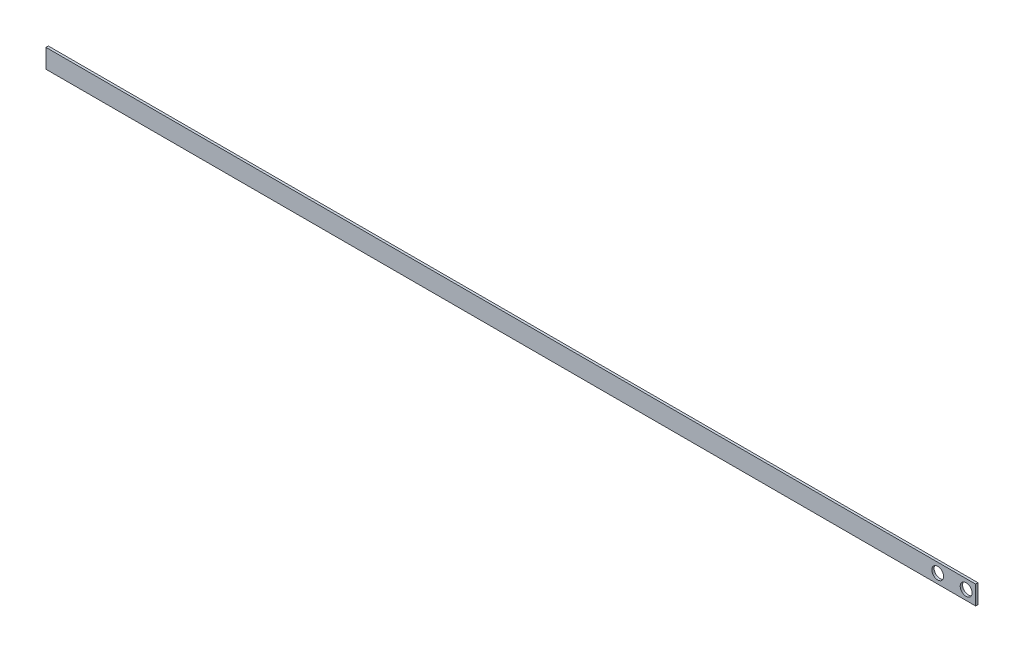
ISO-10303-21;
HEADER;
FILE_DESCRIPTION(('STEP AP214'),'2;1');
FILE_NAME('part.step','',(''),(''),'','','');
FILE_SCHEMA(('AUTOMOTIVE_DESIGN { 1 0 10303 214 1 1 1 1 }'));
ENDSEC;
DATA;
#1=APPLICATION_CONTEXT('core data for automotive mechanical design processes');
#2=APPLICATION_PROTOCOL_DEFINITION('international standard','automotive_design',2000,#1);
#3=PRODUCT_CONTEXT('',#1,'mechanical');
#4=PRODUCT('Part','Part','',(#3));
#5=PRODUCT_RELATED_PRODUCT_CATEGORY('part','',(#4));
#6=PRODUCT_DEFINITION_FORMATION('','',#4);
#7=PRODUCT_DEFINITION_CONTEXT('part definition',#1,'design');
#8=PRODUCT_DEFINITION('design','',#6,#7);
#9=PRODUCT_DEFINITION_SHAPE('','',#8);
#10=(LENGTH_UNIT() NAMED_UNIT(*) SI_UNIT(.MILLI.,.METRE.));
#11=(NAMED_UNIT(*) PLANE_ANGLE_UNIT() SI_UNIT($,.RADIAN.));
#12=(NAMED_UNIT(*) SI_UNIT($,.STERADIAN.) SOLID_ANGLE_UNIT());
#13=UNCERTAINTY_MEASURE_WITH_UNIT(LENGTH_MEASURE(1.E-05),#10,'distance_accuracy_value','');
#14=(GEOMETRIC_REPRESENTATION_CONTEXT(3) GLOBAL_UNCERTAINTY_ASSIGNED_CONTEXT((#13)) GLOBAL_UNIT_ASSIGNED_CONTEXT((#10,
#11,#12)) REPRESENTATION_CONTEXT('',''));
#15=CARTESIAN_POINT('',(0.,0.,0.));
#16=DIRECTION('',(0.,0.,1.));
#17=DIRECTION('',(1.,0.,0.));
#18=AXIS2_PLACEMENT_3D('',#15,#16,#17);
#19=CARTESIAN_POINT('',(0.,0.,0.5));
#20=DIRECTION('',(1.,0.,0.));
#21=DIRECTION('',(0.,1.,0.));
#22=AXIS2_PLACEMENT_3D('',#19,#20,#21);
#23=PLANE('',#22);
#24=DIRECTION('',(0.,-1.,0.));
#25=VECTOR('',#24,1.);
#26=CARTESIAN_POINT('',(0.,0.,0.));
#27=LINE('',#26,#25);
#28=CARTESIAN_POINT('',(0.,0.,0.));
#29=VERTEX_POINT('',#28);
#30=CARTESIAN_POINT('',(0.,-4.,0.));
#31=VERTEX_POINT('',#30);
#32=EDGE_CURVE('E107',#29,#31,#27,.T.);
#33=ORIENTED_EDGE('',*,*,#32,.T.);
#34=DIRECTION('',(0.,0.,-1.));
#35=VECTOR('',#34,1.);
#36=CARTESIAN_POINT('',(0.,-4.,0.5));
#37=LINE('',#36,#35);
#38=CARTESIAN_POINT('',(0.,-4.,0.5));
#39=VERTEX_POINT('',#38);
#40=EDGE_CURVE('E11',#39,#31,#37,.T.);
#41=ORIENTED_EDGE('',*,*,#40,.F.);
#42=DIRECTION('',(0.,-1.,0.));
#43=VECTOR('',#42,1.);
#44=CARTESIAN_POINT('',(0.,0.,0.5));
#45=LINE('',#44,#43);
#46=CARTESIAN_POINT('',(0.,0.,0.5));
#47=VERTEX_POINT('',#46);
#48=EDGE_CURVE('E93',#47,#39,#45,.T.);
#49=ORIENTED_EDGE('',*,*,#48,.F.);
#50=DIRECTION('',(0.,0.,-1.));
#51=VECTOR('',#50,1.);
#52=CARTESIAN_POINT('',(0.,0.,0.5));
#53=LINE('',#52,#51);
#54=EDGE_CURVE('E103',#47,#29,#53,.T.);
#55=ORIENTED_EDGE('',*,*,#54,.T.);
#56=EDGE_LOOP('',(#33,#41,#49,#55));
#57=FACE_BOUND('',#56,.T.);
#58=ADVANCED_FACE('F40',(#57),#23,.F.);
#59=CARTESIAN_POINT('',(0.,-4.,0.5));
#60=DIRECTION('',(0.,1.,0.));
#61=DIRECTION('',(-1.,0.,0.));
#62=AXIS2_PLACEMENT_3D('',#59,#60,#61);
#63=PLANE('',#62);
#64=DIRECTION('',(1.,0.,0.));
#65=VECTOR('',#64,1.);
#66=CARTESIAN_POINT('',(0.,-4.,0.));
#67=LINE('',#66,#65);
#68=CARTESIAN_POINT('',(196.,-4.,0.));
#69=VERTEX_POINT('',#68);
#70=EDGE_CURVE('E97',#31,#69,#67,.T.);
#71=ORIENTED_EDGE('',*,*,#70,.T.);
#72=DIRECTION('',(0.,0.,-1.));
#73=VECTOR('',#72,1.);
#74=CARTESIAN_POINT('',(196.,-4.,0.5));
#75=LINE('',#74,#73);
#76=CARTESIAN_POINT('',(196.,-4.,0.5));
#77=VERTEX_POINT('',#76);
#78=EDGE_CURVE('E49',#77,#69,#75,.T.);
#79=ORIENTED_EDGE('',*,*,#78,.F.);
#80=DIRECTION('',(1.,0.,0.));
#81=VECTOR('',#80,1.);
#82=CARTESIAN_POINT('',(0.,-4.,0.5));
#83=LINE('',#82,#81);
#84=EDGE_CURVE('E88',#39,#77,#83,.T.);
#85=ORIENTED_EDGE('',*,*,#84,.F.);
#86=ORIENTED_EDGE('',*,*,#40,.T.);
#87=EDGE_LOOP('',(#71,#79,#85,#86));
#88=FACE_BOUND('',#87,.T.);
#89=ADVANCED_FACE('F96',(#88),#63,.F.);
#90=CARTESIAN_POINT('',(196.,0.,0.5));
#91=DIRECTION('',(-1.,0.,0.));
#92=DIRECTION('',(0.,0.,1.));
#93=AXIS2_PLACEMENT_3D('',#90,#91,#92);
#94=PLANE('',#93);
#95=DIRECTION('',(0.,1.,0.));
#96=VECTOR('',#95,1.);
#97=CARTESIAN_POINT('',(196.,0.,0.));
#98=LINE('',#97,#96);
#99=CARTESIAN_POINT('',(196.,0.,0.));
#100=VERTEX_POINT('',#99);
#101=EDGE_CURVE('E75',#69,#100,#98,.T.);
#102=ORIENTED_EDGE('',*,*,#101,.T.);
#103=DIRECTION('',(0.,0.,-1.));
#104=VECTOR('',#103,1.);
#105=CARTESIAN_POINT('',(196.,0.,0.5));
#106=LINE('',#105,#104);
#107=CARTESIAN_POINT('',(196.,0.,0.5));
#108=VERTEX_POINT('',#107);
#109=EDGE_CURVE('E98',#108,#100,#106,.T.);
#110=ORIENTED_EDGE('',*,*,#109,.F.);
#111=DIRECTION('',(0.,1.,0.));
#112=VECTOR('',#111,1.);
#113=CARTESIAN_POINT('',(196.,0.,0.5));
#114=LINE('',#113,#112);
#115=EDGE_CURVE('E91',#77,#108,#114,.T.);
#116=ORIENTED_EDGE('',*,*,#115,.F.);
#117=ORIENTED_EDGE('',*,*,#78,.T.);
#118=EDGE_LOOP('',(#102,#110,#116,#117));
#119=FACE_BOUND('',#118,.T.);
#120=ADVANCED_FACE('F100',(#119),#94,.F.);
#121=CARTESIAN_POINT('',(0.,0.,0.5));
#122=DIRECTION('',(0.,-1.,0.));
#123=DIRECTION('',(0.,0.,-1.));
#124=AXIS2_PLACEMENT_3D('',#121,#122,#123);
#125=PLANE('',#124);
#126=DIRECTION('',(-1.,0.,0.));
#127=VECTOR('',#126,1.);
#128=CARTESIAN_POINT('',(0.,0.,0.));
#129=LINE('',#128,#127);
#130=EDGE_CURVE('E81',#100,#29,#129,.T.);
#131=ORIENTED_EDGE('',*,*,#130,.T.);
#132=ORIENTED_EDGE('',*,*,#54,.F.);
#133=DIRECTION('',(-1.,0.,0.));
#134=VECTOR('',#133,1.);
#135=CARTESIAN_POINT('',(0.,0.,0.5));
#136=LINE('',#135,#134);
#137=EDGE_CURVE('E58',#108,#47,#136,.T.);
#138=ORIENTED_EDGE('',*,*,#137,.F.);
#139=ORIENTED_EDGE('',*,*,#109,.T.);
#140=EDGE_LOOP('',(#131,#132,#138,#139));
#141=FACE_BOUND('',#140,.T.);
#142=ADVANCED_FACE('F135',(#141),#125,.F.);
#143=CARTESIAN_POINT('',(0.,-4.,0.5));
#144=DIRECTION('',(0.,0.,1.));
#145=DIRECTION('',(1.,0.,0.));
#146=AXIS2_PLACEMENT_3D('',#143,#144,#145);
#147=PLANE('',#146);
#148=CARTESIAN_POINT('',(194.,-2.,0.5));
#149=DIRECTION('',(0.,0.,1.));
#150=DIRECTION('',(1.,0.,0.));
#151=AXIS2_PLACEMENT_3D('',#148,#149,#150);
#152=CIRCLE('',#151,1.24999999999995);
#153=CARTESIAN_POINT('',(195.25,-2.,0.5));
#154=VERTEX_POINT('',#153);
#155=EDGE_CURVE('E124',#154,#154,#152,.T.);
#156=ORIENTED_EDGE('',*,*,#155,.F.);
#157=EDGE_LOOP('',(#156));
#158=FACE_BOUND('',#157,.T.);
#159=CARTESIAN_POINT('',(188.,-2.,0.5));
#160=DIRECTION('',(0.,0.,1.));
#161=DIRECTION('',(1.,0.,0.));
#162=AXIS2_PLACEMENT_3D('',#159,#160,#161);
#163=CIRCLE('',#162,1.24999999999995);
#164=CARTESIAN_POINT('',(189.25,-2.,0.5));
#165=VERTEX_POINT('',#164);
#166=EDGE_CURVE('E116',#165,#165,#163,.T.);
#167=ORIENTED_EDGE('',*,*,#166,.F.);
#168=EDGE_LOOP('',(#167));
#169=FACE_BOUND('',#168,.T.);
#170=ORIENTED_EDGE('',*,*,#48,.T.);
#171=ORIENTED_EDGE('',*,*,#84,.T.);
#172=ORIENTED_EDGE('',*,*,#115,.T.);
#173=ORIENTED_EDGE('',*,*,#137,.T.);
#174=EDGE_LOOP('',(#170,#171,#172,#173));
#175=FACE_BOUND('',#174,.T.);
#176=ADVANCED_FACE('F89',(#158,#169,#175),#147,.T.);
#177=CARTESIAN_POINT('',(0.,-4.,0.));
#178=DIRECTION('',(0.,0.,1.));
#179=DIRECTION('',(1.,0.,0.));
#180=AXIS2_PLACEMENT_3D('',#177,#178,#179);
#181=PLANE('',#180);
#182=CARTESIAN_POINT('',(194.,-2.,0.));
#183=DIRECTION('',(0.,0.,1.));
#184=DIRECTION('',(1.,0.,0.));
#185=AXIS2_PLACEMENT_3D('',#182,#183,#184);
#186=CIRCLE('',#185,1.24999999999995);
#187=CARTESIAN_POINT('',(195.25,-2.,0.));
#188=VERTEX_POINT('',#187);
#189=EDGE_CURVE('E43',#188,#188,#186,.T.);
#190=ORIENTED_EDGE('',*,*,#189,.T.);
#191=EDGE_LOOP('',(#190));
#192=FACE_BOUND('',#191,.T.);
#193=CARTESIAN_POINT('',(188.,-2.,0.));
#194=DIRECTION('',(0.,0.,1.));
#195=DIRECTION('',(1.,0.,0.));
#196=AXIS2_PLACEMENT_3D('',#193,#194,#195);
#197=CIRCLE('',#196,1.24999999999995);
#198=CARTESIAN_POINT('',(189.25,-2.,0.));
#199=VERTEX_POINT('',#198);
#200=EDGE_CURVE('E110',#199,#199,#197,.T.);
#201=ORIENTED_EDGE('',*,*,#200,.T.);
#202=EDGE_LOOP('',(#201));
#203=FACE_BOUND('',#202,.T.);
#204=ORIENTED_EDGE('',*,*,#32,.F.);
#205=ORIENTED_EDGE('',*,*,#130,.F.);
#206=ORIENTED_EDGE('',*,*,#101,.F.);
#207=ORIENTED_EDGE('',*,*,#70,.F.);
#208=EDGE_LOOP('',(#204,#205,#206,#207));
#209=FACE_BOUND('',#208,.T.);
#210=ADVANCED_FACE('F134',(#192,#203,#209),#181,.F.);
#211=CARTESIAN_POINT('',(188.,-2.,-0.5));
#212=DIRECTION('',(0.,0.,1.));
#213=DIRECTION('',(1.,0.,0.));
#214=AXIS2_PLACEMENT_3D('',#211,#212,#213);
#215=CYLINDRICAL_SURFACE('',#214,1.24999999999995);
#216=ORIENTED_EDGE('',*,*,#166,.T.);
#217=EDGE_LOOP('',(#216));
#218=FACE_BOUND('',#217,.T.);
#219=ORIENTED_EDGE('',*,*,#200,.F.);
#220=EDGE_LOOP('',(#219));
#221=FACE_BOUND('',#220,.T.);
#222=ADVANCED_FACE('F141',(#218,#221),#215,.F.);
#223=CARTESIAN_POINT('',(194.,-2.,-0.5));
#224=DIRECTION('',(0.,0.,1.));
#225=DIRECTION('',(1.,0.,0.));
#226=AXIS2_PLACEMENT_3D('',#223,#224,#225);
#227=CYLINDRICAL_SURFACE('',#226,1.24999999999995);
#228=ORIENTED_EDGE('',*,*,#155,.T.);
#229=EDGE_LOOP('',(#228));
#230=FACE_BOUND('',#229,.T.);
#231=ORIENTED_EDGE('',*,*,#189,.F.);
#232=EDGE_LOOP('',(#231));
#233=FACE_BOUND('',#232,.T.);
#234=ADVANCED_FACE('F129',(#230,#233),#227,.F.);
#235=CLOSED_SHELL('',(#58,#89,#120,#142,#176,#210,#222,#234));
#236=MANIFOLD_SOLID_BREP('B2',#235);
#237=ADVANCED_BREP_SHAPE_REPRESENTATION('',(#18,#236),#14);
#238=SHAPE_DEFINITION_REPRESENTATION(#9,#237);
ENDSEC;
END-ISO-10303-21;
